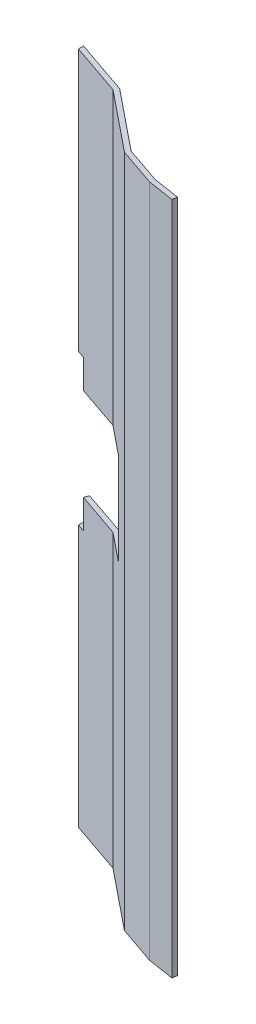
ISO-10303-21;
HEADER;
FILE_DESCRIPTION(('STEP AP214'),'2;1');
FILE_NAME('part.step','',(''),(''),'','','');
FILE_SCHEMA(('AUTOMOTIVE_DESIGN { 1 0 10303 214 1 1 1 1 }'));
ENDSEC;
DATA;
#1=APPLICATION_CONTEXT('core data for automotive mechanical design processes');
#2=APPLICATION_PROTOCOL_DEFINITION('international standard','automotive_design',2000,#1);
#3=PRODUCT_CONTEXT('',#1,'mechanical');
#4=PRODUCT('Part','Part','',(#3));
#5=PRODUCT_RELATED_PRODUCT_CATEGORY('part','',(#4));
#6=PRODUCT_DEFINITION_FORMATION('','',#4);
#7=PRODUCT_DEFINITION_CONTEXT('part definition',#1,'design');
#8=PRODUCT_DEFINITION('design','',#6,#7);
#9=PRODUCT_DEFINITION_SHAPE('','',#8);
#10=(LENGTH_UNIT() NAMED_UNIT(*) SI_UNIT(.MILLI.,.METRE.));
#11=(NAMED_UNIT(*) PLANE_ANGLE_UNIT() SI_UNIT($,.RADIAN.));
#12=(NAMED_UNIT(*) SI_UNIT($,.STERADIAN.) SOLID_ANGLE_UNIT());
#13=UNCERTAINTY_MEASURE_WITH_UNIT(LENGTH_MEASURE(1.E-05),#10,'distance_accuracy_value','');
#14=(GEOMETRIC_REPRESENTATION_CONTEXT(3) GLOBAL_UNCERTAINTY_ASSIGNED_CONTEXT((#13)) GLOBAL_UNIT_ASSIGNED_CONTEXT((#10,
#11,#12)) REPRESENTATION_CONTEXT('',''));
#15=CARTESIAN_POINT('',(0.,0.,0.));
#16=DIRECTION('',(0.,0.,1.));
#17=DIRECTION('',(1.,0.,0.));
#18=AXIS2_PLACEMENT_3D('',#15,#16,#17);
#19=CARTESIAN_POINT('',(-37.0625663664755,222.25,-23.5831818109705));
#20=DIRECTION('',(1.,0.,0.));
#21=DIRECTION('',(0.,0.,-1.));
#22=AXIS2_PLACEMENT_3D('',#19,#20,#21);
#23=PLANE('',#22);
#24=DIRECTION('',(0.,0.,1.));
#25=VECTOR('',#24,1.);
#26=CARTESIAN_POINT('',(-37.0625663664755,86.36,-23.5831818109705));
#27=LINE('',#26,#25);
#28=CARTESIAN_POINT('',(-37.0625663664755,86.36,-23.5831818109705));
#29=VERTEX_POINT('',#28);
#30=CARTESIAN_POINT('',(-37.0625663664755,86.36,-21.904788085952));
#31=VERTEX_POINT('',#30);
#32=EDGE_CURVE('E263',#29,#31,#27,.T.);
#33=ORIENTED_EDGE('',*,*,#32,.F.);
#34=DIRECTION('',(0.,-1.,0.));
#35=VECTOR('',#34,1.);
#36=CARTESIAN_POINT('',(-37.0625663664755,222.25,-23.5831818109705));
#37=LINE('',#36,#35);
#38=CARTESIAN_POINT('',(-37.0625663664755,0.,-23.5831818109705));
#39=VERTEX_POINT('',#38);
#40=EDGE_CURVE('E104',#29,#39,#37,.T.);
#41=ORIENTED_EDGE('',*,*,#40,.T.);
#42=DIRECTION('',(0.,0.,1.));
#43=VECTOR('',#42,1.);
#44=CARTESIAN_POINT('',(-37.0625663664755,0.,-23.5831818109705));
#45=LINE('',#44,#43);
#46=CARTESIAN_POINT('',(-37.0625663664755,0.,-21.904788085952));
#47=VERTEX_POINT('',#46);
#48=EDGE_CURVE('E169',#39,#47,#45,.T.);
#49=ORIENTED_EDGE('',*,*,#48,.T.);
#50=DIRECTION('',(0.,-1.,0.));
#51=VECTOR('',#50,1.);
#52=CARTESIAN_POINT('',(-37.0625663664755,222.25,-21.904788085952));
#53=LINE('',#52,#51);
#54=EDGE_CURVE('E231',#31,#47,#53,.T.);
#55=ORIENTED_EDGE('',*,*,#54,.F.);
#56=EDGE_LOOP('',(#33,#41,#49,#55));
#57=FACE_BOUND('',#56,.T.);
#58=ADVANCED_FACE('F39',(#57),#23,.F.);
#59=CARTESIAN_POINT('',(-37.0625663664755,222.25,-21.904788085952));
#60=DIRECTION('',(0.32461914387771,0.,-0.945844813607445));
#61=DIRECTION('',(-0.945844813607445,0.,-0.32461914387771));
#62=AXIS2_PLACEMENT_3D('',#59,#60,#61);
#63=PLANE('',#62);
#64=DIRECTION('',(0.945844813607445,0.,0.32461914387771));
#65=VECTOR('',#64,1.);
#66=CARTESIAN_POINT('',(-37.0625663664755,86.36,-21.904788085952));
#67=LINE('',#66,#65);
#68=CARTESIAN_POINT('',(-34.5748419741777,86.36,-21.0509873875569));
#69=VERTEX_POINT('',#68);
#70=EDGE_CURVE('E272',#31,#69,#67,.T.);
#71=ORIENTED_EDGE('',*,*,#70,.F.);
#72=ORIENTED_EDGE('',*,*,#54,.T.);
#73=DIRECTION('',(0.945844813607445,0.,0.32461914387771));
#74=VECTOR('',#73,1.);
#75=CARTESIAN_POINT('',(-37.0625663664755,0.,-21.904788085952));
#76=LINE('',#75,#74);
#77=CARTESIAN_POINT('',(-19.7555384832619,0.,-15.964920896652));
#78=VERTEX_POINT('',#77);
#79=EDGE_CURVE('E172',#47,#78,#76,.T.);
#80=ORIENTED_EDGE('',*,*,#79,.T.);
#81=DIRECTION('',(0.,-1.,0.));
#82=VECTOR('',#81,1.);
#83=CARTESIAN_POINT('',(-19.7555384832619,222.25,-15.964920896652));
#84=LINE('',#83,#82);
#85=CARTESIAN_POINT('',(-19.7555384832619,95.885,-15.964920896652));
#86=VERTEX_POINT('',#85);
#87=EDGE_CURVE('E226',#86,#78,#84,.T.);
#88=ORIENTED_EDGE('',*,*,#87,.F.);
#89=DIRECTION('',(0.945844813607445,0.,0.32461914387771));
#90=VECTOR('',#89,1.);
#91=CARTESIAN_POINT('',(-37.0625663664755,95.885,-21.904788085952));
#92=LINE('',#91,#90);
#93=CARTESIAN_POINT('',(-34.5748419741777,95.885,-21.0509873875569));
#94=VERTEX_POINT('',#93);
#95=EDGE_CURVE('E382',#94,#86,#92,.T.);
#96=ORIENTED_EDGE('',*,*,#95,.F.);
#97=DIRECTION('',(0.,-1.,0.));
#98=VECTOR('',#97,1.);
#99=CARTESIAN_POINT('',(-34.5748419741777,222.25,-21.0509873875569));
#100=LINE('',#99,#98);
#101=EDGE_CURVE('E273',#94,#69,#100,.T.);
#102=ORIENTED_EDGE('',*,*,#101,.T.);
#103=EDGE_LOOP('',(#71,#72,#80,#88,#96,#102));
#104=FACE_BOUND('',#103,.T.);
#105=ADVANCED_FACE('F284',(#104),#63,.F.);
#106=CARTESIAN_POINT('',(-19.7555384832619,222.25,-15.964920896652));
#107=DIRECTION('',(0.628540192781588,0.,-0.777777105640224));
#108=DIRECTION('',(-0.777777105640224,0.,-0.628540192781588));
#109=AXIS2_PLACEMENT_3D('',#106,#107,#108);
#110=PLANE('',#109);
#111=DIRECTION('',(0.777777105640224,0.,0.628540192781588));
#112=VECTOR('',#111,1.);
#113=CARTESIAN_POINT('',(-19.7555384832619,95.885,-15.964920896652));
#114=LINE('',#113,#112);
#115=CARTESIAN_POINT('',(-10.1235048545214,95.885,-8.18104524643741));
#116=VERTEX_POINT('',#115);
#117=EDGE_CURVE('E378',#86,#116,#114,.T.);
#118=ORIENTED_EDGE('',*,*,#117,.F.);
#119=ORIENTED_EDGE('',*,*,#87,.T.);
#120=DIRECTION('',(0.777777105640224,0.,0.628540192781588));
#121=VECTOR('',#120,1.);
#122=CARTESIAN_POINT('',(-19.7555384832619,0.,-15.964920896652));
#123=LINE('',#122,#121);
#124=CARTESIAN_POINT('',(-1.85654047094307E-13,0.,3.86479261003734E-13));
#125=VERTEX_POINT('',#124);
#126=EDGE_CURVE('E177',#78,#125,#123,.T.);
#127=ORIENTED_EDGE('',*,*,#126,.T.);
#128=DIRECTION('',(0.,-1.,0.));
#129=VECTOR('',#128,1.);
#130=CARTESIAN_POINT('',(-1.85654047094307E-13,222.25,3.86479261003734E-13));
#131=LINE('',#130,#129);
#132=CARTESIAN_POINT('',(-1.85654047094307E-13,222.25,3.86479261003734E-13));
#133=VERTEX_POINT('',#132);
#134=EDGE_CURVE('E222',#133,#125,#131,.T.);
#135=ORIENTED_EDGE('',*,*,#134,.F.);
#136=DIRECTION('',(0.777777105640224,0.,0.628540192781588));
#137=VECTOR('',#136,1.);
#138=CARTESIAN_POINT('',(-19.7555384832619,222.25,-15.964920896652));
#139=LINE('',#138,#137);
#140=CARTESIAN_POINT('',(-19.7555384832619,222.25,-15.964920896652));
#141=VERTEX_POINT('',#140);
#142=EDGE_CURVE('E305',#141,#133,#139,.T.);
#143=ORIENTED_EDGE('',*,*,#142,.F.);
#144=CARTESIAN_POINT('',(-19.7555384832619,126.365,-15.964920896652));
#145=VERTEX_POINT('',#144);
#146=EDGE_CURVE('E227',#141,#145,#84,.T.);
#147=ORIENTED_EDGE('',*,*,#146,.T.);
#148=DIRECTION('',(0.777777105640224,0.,0.628540192781588));
#149=VECTOR('',#148,1.);
#150=CARTESIAN_POINT('',(-19.7555384832619,126.365,-15.964920896652));
#151=LINE('',#150,#149);
#152=CARTESIAN_POINT('',(-10.1235048545214,126.365,-8.18104524643741));
#153=VERTEX_POINT('',#152);
#154=EDGE_CURVE('E368',#145,#153,#151,.T.);
#155=ORIENTED_EDGE('',*,*,#154,.T.);
#156=DIRECTION('',(0.,-1.,0.));
#157=VECTOR('',#156,1.);
#158=CARTESIAN_POINT('',(-10.1235048545214,222.25,-8.18104524643739));
#159=LINE('',#158,#157);
#160=EDGE_CURVE('E173',#153,#116,#159,.T.);
#161=ORIENTED_EDGE('',*,*,#160,.T.);
#162=EDGE_LOOP('',(#118,#119,#127,#135,#143,#147,#155,#161));
#163=FACE_BOUND('',#162,.T.);
#164=ADVANCED_FACE('F295',(#163),#110,.F.);
#165=CARTESIAN_POINT('',(0.780092902725611,222.25,-1.41066154888906));
#166=DIRECTION('',(-0.628540192781588,0.,0.777777105640224));
#167=DIRECTION('',(0.777777105640224,0.,0.628540192781588));
#168=AXIS2_PLACEMENT_3D('',#165,#166,#167);
#169=PLANE('',#168);
#170=DIRECTION('',(-0.777777105640224,0.,-0.628540192781588));
#171=VECTOR('',#170,1.);
#172=CARTESIAN_POINT('',(0.780092902725611,95.885,-1.41066154888906));
#173=LINE('',#172,#171);
#174=CARTESIAN_POINT('',(-9.5750990465936,95.885,-9.77893865156602));
#175=VERTEX_POINT('',#174);
#176=CARTESIAN_POINT('',(-18.9754455805351,95.885,-17.3755824455406));
#177=VERTEX_POINT('',#176);
#178=EDGE_CURVE('E329',#175,#177,#173,.T.);
#179=ORIENTED_EDGE('',*,*,#178,.F.);
#180=DIRECTION('',(0.,1.,0.));
#181=VECTOR('',#180,1.);
#182=CARTESIAN_POINT('',(-9.57509904659358,222.25,-9.77893865156601));
#183=LINE('',#182,#181);
#184=CARTESIAN_POINT('',(-9.5750990465936,126.365,-9.77893865156603));
#185=VERTEX_POINT('',#184);
#186=EDGE_CURVE('E11',#175,#185,#183,.T.);
#187=ORIENTED_EDGE('',*,*,#186,.T.);
#188=DIRECTION('',(-0.777777105640224,0.,-0.628540192781588));
#189=VECTOR('',#188,1.);
#190=CARTESIAN_POINT('',(0.780092902725611,126.365,-1.41066154888906));
#191=LINE('',#190,#189);
#192=CARTESIAN_POINT('',(-18.9754455805351,126.365,-17.3755824455406));
#193=VERTEX_POINT('',#192);
#194=EDGE_CURVE('E365',#185,#193,#191,.T.);
#195=ORIENTED_EDGE('',*,*,#194,.T.);
#196=DIRECTION('',(0.,-1.,0.));
#197=VECTOR('',#196,1.);
#198=CARTESIAN_POINT('',(-18.9754455805351,222.25,-17.3755824455406));
#199=LINE('',#198,#197);
#200=CARTESIAN_POINT('',(-18.9754455805351,222.25,-17.3755824455406));
#201=VERTEX_POINT('',#200);
#202=EDGE_CURVE('E157',#201,#193,#199,.T.);
#203=ORIENTED_EDGE('',*,*,#202,.F.);
#204=DIRECTION('',(-0.777777105640224,0.,-0.628540192781588));
#205=VECTOR('',#204,1.);
#206=CARTESIAN_POINT('',(0.780092902725611,222.25,-1.41066154888906));
#207=LINE('',#206,#205);
#208=CARTESIAN_POINT('',(0.780092902725611,222.25,-1.41066154888906));
#209=VERTEX_POINT('',#208);
#210=EDGE_CURVE('E138',#209,#201,#207,.T.);
#211=ORIENTED_EDGE('',*,*,#210,.F.);
#212=DIRECTION('',(0.,-1.,0.));
#213=VECTOR('',#212,1.);
#214=CARTESIAN_POINT('',(0.780092902725611,222.25,-1.41066154888906));
#215=LINE('',#214,#213);
#216=CARTESIAN_POINT('',(0.780092902725611,0.,-1.41066154888906));
#217=VERTEX_POINT('',#216);
#218=EDGE_CURVE('E148',#209,#217,#215,.T.);
#219=ORIENTED_EDGE('',*,*,#218,.T.);
#220=DIRECTION('',(-0.777777105640224,0.,-0.628540192781588));
#221=VECTOR('',#220,1.);
#222=CARTESIAN_POINT('',(0.780092902725611,0.,-1.41066154888906));
#223=LINE('',#222,#221);
#224=CARTESIAN_POINT('',(-18.9754455805351,0.,-17.3755824455406));
#225=VERTEX_POINT('',#224);
#226=EDGE_CURVE('E194',#217,#225,#223,.T.);
#227=ORIENTED_EDGE('',*,*,#226,.T.);
#228=EDGE_CURVE('E205',#177,#225,#199,.T.);
#229=ORIENTED_EDGE('',*,*,#228,.F.);
#230=EDGE_LOOP('',(#179,#187,#195,#203,#211,#219,#227,#229));
#231=FACE_BOUND('',#230,.T.);
#232=ADVANCED_FACE('F160',(#231),#169,.F.);
#233=CARTESIAN_POINT('',(-18.9754455805351,222.25,-17.3755824455406));
#234=DIRECTION('',(-0.32461914387771,0.,0.945844813607445));
#235=DIRECTION('',(0.945844813607445,0.,0.32461914387771));
#236=AXIS2_PLACEMENT_3D('',#233,#234,#235);
#237=PLANE('',#236);
#238=DIRECTION('',(-0.945844813607445,0.,-0.32461914387771));
#239=VECTOR('',#238,1.);
#240=CARTESIAN_POINT('',(-18.9754455805351,86.36,-17.3755824455406));
#241=LINE('',#240,#239);
#242=CARTESIAN_POINT('',(-34.0595090832718,86.36,-22.5525160291587));
#243=VERTEX_POINT('',#242);
#244=EDGE_CURVE('E48',#243,#29,#241,.T.);
#245=ORIENTED_EDGE('',*,*,#244,.F.);
#246=DIRECTION('',(0.,1.,0.));
#247=VECTOR('',#246,1.);
#248=CARTESIAN_POINT('',(-34.0595090832718,222.25,-22.5525160291587));
#249=LINE('',#248,#247);
#250=CARTESIAN_POINT('',(-34.0595090832718,95.885,-22.5525160291588));
#251=VERTEX_POINT('',#250);
#252=EDGE_CURVE('E250',#243,#251,#249,.T.);
#253=ORIENTED_EDGE('',*,*,#252,.T.);
#254=DIRECTION('',(-0.945844813607445,0.,-0.32461914387771));
#255=VECTOR('',#254,1.);
#256=CARTESIAN_POINT('',(-18.9754455805351,95.885,-17.3755824455406));
#257=LINE('',#256,#255);
#258=EDGE_CURVE('E246',#177,#251,#257,.T.);
#259=ORIENTED_EDGE('',*,*,#258,.F.);
#260=ORIENTED_EDGE('',*,*,#228,.T.);
#261=DIRECTION('',(-0.945844813607445,0.,-0.32461914387771));
#262=VECTOR('',#261,1.);
#263=CARTESIAN_POINT('',(-18.9754455805351,0.,-17.3755824455406));
#264=LINE('',#263,#262);
#265=EDGE_CURVE('E197',#225,#39,#264,.T.);
#266=ORIENTED_EDGE('',*,*,#265,.T.);
#267=ORIENTED_EDGE('',*,*,#40,.F.);
#268=EDGE_LOOP('',(#245,#253,#259,#260,#266,#267));
#269=FACE_BOUND('',#268,.T.);
#270=ADVANCED_FACE('F275',(#269),#237,.F.);
#271=CARTESIAN_POINT('',(-37.0625663664755,222.25,-23.5831818109705));
#272=VERTEX_POINT('',#271);
#273=CARTESIAN_POINT('',(-37.0625663664755,135.89,-23.5831818109705));
#274=VERTEX_POINT('',#273);
#275=EDGE_CURVE('E201',#272,#274,#37,.T.);
#276=ORIENTED_EDGE('',*,*,#275,.T.);
#277=DIRECTION('',(0.,0.,1.));
#278=VECTOR('',#277,1.);
#279=CARTESIAN_POINT('',(-37.0625663664755,135.89,-23.5831818109705));
#280=LINE('',#279,#278);
#281=CARTESIAN_POINT('',(-37.0625663664755,135.89,-21.904788085952));
#282=VERTEX_POINT('',#281);
#283=EDGE_CURVE('E389',#274,#282,#280,.T.);
#284=ORIENTED_EDGE('',*,*,#283,.T.);
#285=CARTESIAN_POINT('',(-37.0625663664755,222.25,-21.904788085952));
#286=VERTEX_POINT('',#285);
#287=EDGE_CURVE('E232',#286,#282,#53,.T.);
#288=ORIENTED_EDGE('',*,*,#287,.F.);
#289=DIRECTION('',(0.,0.,1.));
#290=VECTOR('',#289,1.);
#291=CARTESIAN_POINT('',(-37.0625663664755,222.25,-23.5831818109705));
#292=LINE('',#291,#290);
#293=EDGE_CURVE('E200',#272,#286,#292,.T.);
#294=ORIENTED_EDGE('',*,*,#293,.F.);
#295=EDGE_LOOP('',(#276,#284,#288,#294));
#296=FACE_BOUND('',#295,.T.);
#297=ADVANCED_FACE('F41',(#296),#23,.F.);
#298=ORIENTED_EDGE('',*,*,#287,.T.);
#299=DIRECTION('',(0.945844813607445,0.,0.32461914387771));
#300=VECTOR('',#299,1.);
#301=CARTESIAN_POINT('',(-37.0625663664755,135.89,-21.904788085952));
#302=LINE('',#301,#300);
#303=CARTESIAN_POINT('',(-34.5748419741777,135.89,-21.0509873875569));
#304=VERTEX_POINT('',#303);
#305=EDGE_CURVE('E393',#282,#304,#302,.T.);
#306=ORIENTED_EDGE('',*,*,#305,.T.);
#307=DIRECTION('',(0.,1.,0.));
#308=VECTOR('',#307,1.);
#309=CARTESIAN_POINT('',(-34.5748419741777,222.25,-21.0509873875569));
#310=LINE('',#309,#308);
#311=CARTESIAN_POINT('',(-34.5748419741777,126.365,-21.0509873875569));
#312=VERTEX_POINT('',#311);
#313=EDGE_CURVE('E397',#312,#304,#310,.T.);
#314=ORIENTED_EDGE('',*,*,#313,.F.);
#315=DIRECTION('',(0.945844813607445,0.,0.32461914387771));
#316=VECTOR('',#315,1.);
#317=CARTESIAN_POINT('',(-37.0625663664755,126.365,-21.904788085952));
#318=LINE('',#317,#316);
#319=EDGE_CURVE('E372',#312,#145,#318,.T.);
#320=ORIENTED_EDGE('',*,*,#319,.T.);
#321=ORIENTED_EDGE('',*,*,#146,.F.);
#322=DIRECTION('',(0.945844813607445,0.,0.32461914387771));
#323=VECTOR('',#322,1.);
#324=CARTESIAN_POINT('',(-37.0625663664755,222.25,-21.904788085952));
#325=LINE('',#324,#323);
#326=EDGE_CURVE('E113',#286,#141,#325,.T.);
#327=ORIENTED_EDGE('',*,*,#326,.F.);
#328=EDGE_LOOP('',(#298,#306,#314,#320,#321,#327));
#329=FACE_BOUND('',#328,.T.);
#330=ADVANCED_FACE('F408',(#329),#63,.F.);
#331=CARTESIAN_POINT('',(-1.85654047094307E-13,222.25,3.86479261003734E-13));
#332=DIRECTION('',(0.32461914387771,0.,-0.945844813607445));
#333=DIRECTION('',(-0.945844813607445,0.,-0.32461914387771));
#334=AXIS2_PLACEMENT_3D('',#331,#332,#333);
#335=PLANE('',#334);
#336=DIRECTION('',(0.945844813607445,0.,0.32461914387771));
#337=VECTOR('',#336,1.);
#338=CARTESIAN_POINT('',(-1.85654047094307E-13,0.,3.86479261003734E-13));
#339=LINE('',#338,#337);
#340=CARTESIAN_POINT('',(12.5417491564539,0.,4.30439731267288));
#341=VERTEX_POINT('',#340);
#342=EDGE_CURVE('E180',#125,#341,#339,.T.);
#343=ORIENTED_EDGE('',*,*,#342,.T.);
#344=DIRECTION('',(0.,-1.,0.));
#345=VECTOR('',#344,1.);
#346=CARTESIAN_POINT('',(12.5417491564539,222.25,4.30439731267288));
#347=LINE('',#346,#345);
#348=CARTESIAN_POINT('',(12.5417491564539,222.25,4.30439731267288));
#349=VERTEX_POINT('',#348);
#350=EDGE_CURVE('E218',#349,#341,#347,.T.);
#351=ORIENTED_EDGE('',*,*,#350,.F.);
#352=DIRECTION('',(0.945844813607445,0.,0.32461914387771));
#353=VECTOR('',#352,1.);
#354=CARTESIAN_POINT('',(-1.85654047094307E-13,222.25,3.86479261003734E-13));
#355=LINE('',#354,#353);
#356=EDGE_CURVE('E301',#133,#349,#355,.T.);
#357=ORIENTED_EDGE('',*,*,#356,.F.);
#358=ORIENTED_EDGE('',*,*,#134,.T.);
#359=EDGE_LOOP('',(#343,#351,#357,#358));
#360=FACE_BOUND('',#359,.T.);
#361=ADVANCED_FACE('F299',(#360),#335,.F.);
#362=CARTESIAN_POINT('',(12.5417491564539,222.25,4.30439731267288));
#363=DIRECTION('',(0.155443221428295,0.,-0.987844828357164));
#364=DIRECTION('',(-0.987844828357164,0.,-0.155443221428295));
#365=AXIS2_PLACEMENT_3D('',#362,#363,#364);
#366=PLANE('',#365);
#367=DIRECTION('',(0.987844828357164,0.,0.155443221428295));
#368=VECTOR('',#367,1.);
#369=CARTESIAN_POINT('',(12.5417491564539,0.,4.30439731267288));
#370=LINE('',#369,#368);
#371=CARTESIAN_POINT('',(21.3236896805516,0.,5.68628755117083));
#372=VERTEX_POINT('',#371);
#373=EDGE_CURVE('E183',#341,#372,#370,.T.);
#374=ORIENTED_EDGE('',*,*,#373,.T.);
#375=DIRECTION('',(0.,-1.,0.));
#376=VECTOR('',#375,1.);
#377=CARTESIAN_POINT('',(21.3236896805516,222.25,5.68628755117083));
#378=LINE('',#377,#376);
#379=CARTESIAN_POINT('',(21.3236896805516,222.25,5.68628755117083));
#380=VERTEX_POINT('',#379);
#381=EDGE_CURVE('E214',#380,#372,#378,.T.);
#382=ORIENTED_EDGE('',*,*,#381,.F.);
#383=DIRECTION('',(0.987844828357164,0.,0.155443221428295));
#384=VECTOR('',#383,1.);
#385=CARTESIAN_POINT('',(12.5417491564539,222.25,4.30439731267288));
#386=LINE('',#385,#384);
#387=EDGE_CURVE('E304',#349,#380,#386,.T.);
#388=ORIENTED_EDGE('',*,*,#387,.F.);
#389=ORIENTED_EDGE('',*,*,#350,.T.);
#390=EDGE_LOOP('',(#374,#382,#388,#389));
#391=FACE_BOUND('',#390,.T.);
#392=ADVANCED_FACE('F493',(#391),#366,.F.);
#393=CARTESIAN_POINT('',(21.3236896805516,222.25,5.68628755117083));
#394=DIRECTION('',(-0.987844828357163,0.,-0.155443221428296));
#395=DIRECTION('',(-0.155443221428296,0.,0.987844828357163));
#396=AXIS2_PLACEMENT_3D('',#393,#394,#395);
#397=PLANE('',#396);
#398=DIRECTION('',(0.155443221428296,0.,-0.987844828357163));
#399=VECTOR('',#398,1.);
#400=CARTESIAN_POINT('',(21.3236896805516,0.,5.68628755117083));
#401=LINE('',#400,#399);
#402=CARTESIAN_POINT('',(21.5742625596366,0.,4.09389181685581));
#403=VERTEX_POINT('',#402);
#404=EDGE_CURVE('E186',#372,#403,#401,.T.);
#405=ORIENTED_EDGE('',*,*,#404,.T.);
#406=DIRECTION('',(0.,-1.,0.));
#407=VECTOR('',#406,1.);
#408=CARTESIAN_POINT('',(21.5742625596366,222.25,4.09389181685581));
#409=LINE('',#408,#407);
#410=CARTESIAN_POINT('',(21.5742625596366,222.25,4.09389181685581));
#411=VERTEX_POINT('',#410);
#412=EDGE_CURVE('E210',#411,#403,#409,.T.);
#413=ORIENTED_EDGE('',*,*,#412,.F.);
#414=DIRECTION('',(0.155443221428296,0.,-0.987844828357163));
#415=VECTOR('',#414,1.);
#416=CARTESIAN_POINT('',(21.3236896805516,222.25,5.68628755117083));
#417=LINE('',#416,#415);
#418=EDGE_CURVE('E309',#380,#411,#417,.T.);
#419=ORIENTED_EDGE('',*,*,#418,.F.);
#420=ORIENTED_EDGE('',*,*,#381,.T.);
#421=EDGE_LOOP('',(#405,#413,#419,#420));
#422=FACE_BOUND('',#421,.T.);
#423=ADVANCED_FACE('F320',(#422),#397,.F.);
#424=CARTESIAN_POINT('',(21.5742625596366,222.25,4.09389181685581));
#425=DIRECTION('',(-0.155443221428295,0.,0.987844828357164));
#426=DIRECTION('',(0.987844828357164,0.,0.155443221428295));
#427=AXIS2_PLACEMENT_3D('',#424,#425,#426);
#428=PLANE('',#427);
#429=DIRECTION('',(-0.987844828357164,0.,-0.155443221428295));
#430=VECTOR('',#429,1.);
#431=CARTESIAN_POINT('',(21.5742625596366,0.,4.09389181685581));
#432=LINE('',#431,#430);
#433=CARTESIAN_POINT('',(12.7923220355414,0.,2.71200157835827));
#434=VERTEX_POINT('',#433);
#435=EDGE_CURVE('E189',#403,#434,#432,.T.);
#436=ORIENTED_EDGE('',*,*,#435,.T.);
#437=DIRECTION('',(0.,-1.,0.));
#438=VECTOR('',#437,1.);
#439=CARTESIAN_POINT('',(12.7923220355414,222.25,2.71200157835827));
#440=LINE('',#439,#438);
#441=CARTESIAN_POINT('',(12.7923220355414,222.25,2.71200157835827));
#442=VERTEX_POINT('',#441);
#443=EDGE_CURVE('E156',#442,#434,#440,.T.);
#444=ORIENTED_EDGE('',*,*,#443,.F.);
#445=DIRECTION('',(-0.987844828357164,0.,-0.155443221428295));
#446=VECTOR('',#445,1.);
#447=CARTESIAN_POINT('',(21.5742625596366,222.25,4.09389181685581));
#448=LINE('',#447,#446);
#449=EDGE_CURVE('E141',#411,#442,#448,.T.);
#450=ORIENTED_EDGE('',*,*,#449,.F.);
#451=ORIENTED_EDGE('',*,*,#412,.T.);
#452=EDGE_LOOP('',(#436,#444,#450,#451));
#453=FACE_BOUND('',#452,.T.);
#454=ADVANCED_FACE('F324',(#453),#428,.F.);
#455=CARTESIAN_POINT('',(12.7923220355414,222.25,2.71200157835827));
#456=DIRECTION('',(-0.32461914387771,0.,0.945844813607445));
#457=DIRECTION('',(0.945844813607445,0.,0.32461914387771));
#458=AXIS2_PLACEMENT_3D('',#455,#456,#457);
#459=PLANE('',#458);
#460=DIRECTION('',(-0.945844813607445,0.,-0.32461914387771));
#461=VECTOR('',#460,1.);
#462=CARTESIAN_POINT('',(12.7923220355414,0.,2.71200157835827));
#463=LINE('',#462,#461);
#464=EDGE_CURVE('E151',#434,#217,#463,.T.);
#465=ORIENTED_EDGE('',*,*,#464,.T.);
#466=ORIENTED_EDGE('',*,*,#218,.F.);
#467=DIRECTION('',(-0.945844813607445,0.,-0.32461914387771));
#468=VECTOR('',#467,1.);
#469=CARTESIAN_POINT('',(12.7923220355414,222.25,2.71200157835827));
#470=LINE('',#469,#468);
#471=EDGE_CURVE('E134',#442,#209,#470,.T.);
#472=ORIENTED_EDGE('',*,*,#471,.F.);
#473=ORIENTED_EDGE('',*,*,#443,.T.);
#474=EDGE_LOOP('',(#465,#466,#472,#473));
#475=FACE_BOUND('',#474,.T.);
#476=ADVANCED_FACE('F149',(#475),#459,.F.);
#477=DIRECTION('',(0.,-1.,0.));
#478=VECTOR('',#477,1.);
#479=CARTESIAN_POINT('',(-34.0595090832718,222.25,-22.5525160291587));
#480=LINE('',#479,#478);
#481=CARTESIAN_POINT('',(-34.0595090832718,135.89,-22.5525160291587));
#482=VERTEX_POINT('',#481);
#483=CARTESIAN_POINT('',(-34.0595090832718,126.365,-22.5525160291587));
#484=VERTEX_POINT('',#483);
#485=EDGE_CURVE('E239',#482,#484,#480,.T.);
#486=ORIENTED_EDGE('',*,*,#485,.F.);
#487=DIRECTION('',(-0.945844813607445,0.,-0.32461914387771));
#488=VECTOR('',#487,1.);
#489=CARTESIAN_POINT('',(-18.9754455805351,135.89,-17.3755824455406));
#490=LINE('',#489,#488);
#491=EDGE_CURVE('E242',#482,#274,#490,.T.);
#492=ORIENTED_EDGE('',*,*,#491,.T.);
#493=ORIENTED_EDGE('',*,*,#275,.F.);
#494=DIRECTION('',(-0.945844813607445,0.,-0.32461914387771));
#495=VECTOR('',#494,1.);
#496=CARTESIAN_POINT('',(-18.9754455805351,222.25,-17.3755824455406));
#497=LINE('',#496,#495);
#498=EDGE_CURVE('E64',#201,#272,#497,.T.);
#499=ORIENTED_EDGE('',*,*,#498,.F.);
#500=ORIENTED_EDGE('',*,*,#202,.T.);
#501=DIRECTION('',(-0.945844813607445,0.,-0.32461914387771));
#502=VECTOR('',#501,1.);
#503=CARTESIAN_POINT('',(-18.9754455805351,126.365,-17.3755824455406));
#504=LINE('',#503,#502);
#505=EDGE_CURVE('E235',#193,#484,#504,.T.);
#506=ORIENTED_EDGE('',*,*,#505,.T.);
#507=EDGE_LOOP('',(#486,#492,#493,#499,#500,#506));
#508=FACE_BOUND('',#507,.T.);
#509=ADVANCED_FACE('F443',(#508),#237,.F.);
#510=CARTESIAN_POINT('',(0.,222.25,0.));
#511=DIRECTION('',(0.,1.,0.));
#512=DIRECTION('',(0.,0.,1.));
#513=AXIS2_PLACEMENT_3D('',#510,#511,#512);
#514=PLANE('',#513);
#515=ORIENTED_EDGE('',*,*,#293,.T.);
#516=ORIENTED_EDGE('',*,*,#326,.T.);
#517=ORIENTED_EDGE('',*,*,#142,.T.);
#518=ORIENTED_EDGE('',*,*,#356,.T.);
#519=ORIENTED_EDGE('',*,*,#387,.T.);
#520=ORIENTED_EDGE('',*,*,#418,.T.);
#521=ORIENTED_EDGE('',*,*,#449,.T.);
#522=ORIENTED_EDGE('',*,*,#471,.T.);
#523=ORIENTED_EDGE('',*,*,#210,.T.);
#524=ORIENTED_EDGE('',*,*,#498,.T.);
#525=EDGE_LOOP('',(#515,#516,#517,#518,#519,#520,#521,#522,#523,#524));
#526=FACE_BOUND('',#525,.T.);
#527=ADVANCED_FACE('F136',(#526),#514,.T.);
#528=CARTESIAN_POINT('',(0.,0.,0.));
#529=DIRECTION('',(0.,1.,0.));
#530=DIRECTION('',(0.,0.,1.));
#531=AXIS2_PLACEMENT_3D('',#528,#529,#530);
#532=PLANE('',#531);
#533=ORIENTED_EDGE('',*,*,#48,.F.);
#534=ORIENTED_EDGE('',*,*,#265,.F.);
#535=ORIENTED_EDGE('',*,*,#226,.F.);
#536=ORIENTED_EDGE('',*,*,#464,.F.);
#537=ORIENTED_EDGE('',*,*,#435,.F.);
#538=ORIENTED_EDGE('',*,*,#404,.F.);
#539=ORIENTED_EDGE('',*,*,#373,.F.);
#540=ORIENTED_EDGE('',*,*,#342,.F.);
#541=ORIENTED_EDGE('',*,*,#126,.F.);
#542=ORIENTED_EDGE('',*,*,#79,.F.);
#543=EDGE_LOOP('',(#533,#534,#535,#536,#537,#538,#539,#540,#541,#542));
#544=FACE_BOUND('',#543,.T.);
#545=ADVANCED_FACE('F289',(#544),#532,.F.);
#546=CARTESIAN_POINT('',(-17.2200948165055,0.,12.496332956402));
#547=DIRECTION('',(0.945844813607445,0.,0.32461914387771));
#548=DIRECTION('',(0.32461914387771,0.,-0.945844813607445));
#549=AXIS2_PLACEMENT_3D('',#546,#547,#548);
#550=PLANE('',#549);
#551=DIRECTION('',(0.32461914387771,0.,-0.945844813607445));
#552=VECTOR('',#551,1.);
#553=CARTESIAN_POINT('',(-17.2200948165055,126.365,12.496332956402));
#554=LINE('',#553,#552);
#555=EDGE_CURVE('E356',#153,#185,#554,.T.);
#556=ORIENTED_EDGE('',*,*,#555,.T.);
#557=ORIENTED_EDGE('',*,*,#186,.F.);
#558=DIRECTION('',(0.32461914387771,0.,-0.945844813607445));
#559=VECTOR('',#558,1.);
#560=CARTESIAN_POINT('',(-17.2200948165055,95.885,12.496332956402));
#561=LINE('',#560,#559);
#562=EDGE_CURVE('E350',#116,#175,#561,.T.);
#563=ORIENTED_EDGE('',*,*,#562,.F.);
#564=ORIENTED_EDGE('',*,*,#160,.F.);
#565=EDGE_LOOP('',(#556,#557,#563,#564));
#566=FACE_BOUND('',#565,.T.);
#567=ADVANCED_FACE('F454',(#566),#550,.F.);
#568=CARTESIAN_POINT('',(-43.0463874520568,0.,3.63260723282109));
#569=DIRECTION('',(-0.945844813607445,0.,-0.32461914387771));
#570=DIRECTION('',(-0.32461914387771,0.,0.945844813607445));
#571=AXIS2_PLACEMENT_3D('',#568,#569,#570);
#572=PLANE('',#571);
#573=ORIENTED_EDGE('',*,*,#313,.T.);
#574=DIRECTION('',(0.32461914387771,0.,-0.945844813607445));
#575=VECTOR('',#574,1.);
#576=CARTESIAN_POINT('',(-43.0463874520568,135.89,3.63260723282109));
#577=LINE('',#576,#575);
#578=EDGE_CURVE('E354',#304,#482,#577,.T.);
#579=ORIENTED_EDGE('',*,*,#578,.T.);
#580=ORIENTED_EDGE('',*,*,#485,.T.);
#581=DIRECTION('',(0.32461914387771,0.,-0.945844813607445));
#582=VECTOR('',#581,1.);
#583=CARTESIAN_POINT('',(-43.0463874520568,126.365,3.63260723282108));
#584=LINE('',#583,#582);
#585=EDGE_CURVE('E55',#312,#484,#584,.T.);
#586=ORIENTED_EDGE('',*,*,#585,.F.);
#587=EDGE_LOOP('',(#573,#579,#580,#586));
#588=FACE_BOUND('',#587,.T.);
#589=ADVANCED_FACE('F445',(#588),#572,.T.);
#590=CARTESIAN_POINT('',(-5.65147781055028,135.89,16.4667459610462));
#591=DIRECTION('',(0.,1.,0.));
#592=DIRECTION('',(0.,0.,1.));
#593=AXIS2_PLACEMENT_3D('',#590,#591,#592);
#594=PLANE('',#593);
#595=ORIENTED_EDGE('',*,*,#283,.F.);
#596=ORIENTED_EDGE('',*,*,#491,.F.);
#597=ORIENTED_EDGE('',*,*,#578,.F.);
#598=ORIENTED_EDGE('',*,*,#305,.F.);
#599=EDGE_LOOP('',(#595,#596,#597,#598));
#600=FACE_BOUND('',#599,.T.);
#601=ADVANCED_FACE('F439',(#600),#594,.F.);
#602=CARTESIAN_POINT('',(-5.65147781055028,86.36,16.4667459610462));
#603=DIRECTION('',(0.,1.,0.));
#604=DIRECTION('',(0.,0.,1.));
#605=AXIS2_PLACEMENT_3D('',#602,#603,#604);
#606=PLANE('',#605);
#607=ORIENTED_EDGE('',*,*,#70,.T.);
#608=DIRECTION('',(0.32461914387771,0.,-0.945844813607445));
#609=VECTOR('',#608,1.);
#610=CARTESIAN_POINT('',(-43.0463874520568,86.36,3.63260723282109));
#611=LINE('',#610,#609);
#612=EDGE_CURVE('E267',#69,#243,#611,.T.);
#613=ORIENTED_EDGE('',*,*,#612,.T.);
#614=ORIENTED_EDGE('',*,*,#244,.T.);
#615=ORIENTED_EDGE('',*,*,#32,.T.);
#616=EDGE_LOOP('',(#607,#613,#614,#615));
#617=FACE_BOUND('',#616,.T.);
#618=ADVANCED_FACE('F261',(#617),#606,.T.);
#619=CARTESIAN_POINT('',(-43.0463874520568,0.,3.63260723282108));
#620=DIRECTION('',(0.945844813607445,0.,0.32461914387771));
#621=DIRECTION('',(0.32461914387771,0.,-0.945844813607445));
#622=AXIS2_PLACEMENT_3D('',#619,#620,#621);
#623=PLANE('',#622);
#624=DIRECTION('',(0.32461914387771,0.,-0.945844813607445));
#625=VECTOR('',#624,1.);
#626=CARTESIAN_POINT('',(-43.0463874520568,95.885,3.63260723282108));
#627=LINE('',#626,#625);
#628=EDGE_CURVE('E341',#94,#251,#627,.T.);
#629=ORIENTED_EDGE('',*,*,#628,.T.);
#630=ORIENTED_EDGE('',*,*,#252,.F.);
#631=ORIENTED_EDGE('',*,*,#612,.F.);
#632=ORIENTED_EDGE('',*,*,#101,.F.);
#633=EDGE_LOOP('',(#629,#630,#631,#632));
#634=FACE_BOUND('',#633,.T.);
#635=ADVANCED_FACE('F348',(#634),#623,.F.);
#636=CARTESIAN_POINT('',(-5.65147781055028,95.885,16.4667459610462));
#637=DIRECTION('',(0.,1.,0.));
#638=DIRECTION('',(0.,0.,1.));
#639=AXIS2_PLACEMENT_3D('',#636,#637,#638);
#640=PLANE('',#639);
#641=ORIENTED_EDGE('',*,*,#95,.T.);
#642=ORIENTED_EDGE('',*,*,#117,.T.);
#643=ORIENTED_EDGE('',*,*,#562,.T.);
#644=ORIENTED_EDGE('',*,*,#178,.T.);
#645=ORIENTED_EDGE('',*,*,#258,.T.);
#646=ORIENTED_EDGE('',*,*,#628,.F.);
#647=EDGE_LOOP('',(#641,#642,#643,#644,#645,#646));
#648=FACE_BOUND('',#647,.T.);
#649=ADVANCED_FACE('F339',(#648),#640,.T.);
#650=CARTESIAN_POINT('',(-5.65147781055028,126.365,16.4667459610462));
#651=DIRECTION('',(0.,1.,0.));
#652=DIRECTION('',(0.,0.,1.));
#653=AXIS2_PLACEMENT_3D('',#650,#651,#652);
#654=PLANE('',#653);
#655=ORIENTED_EDGE('',*,*,#585,.T.);
#656=ORIENTED_EDGE('',*,*,#505,.F.);
#657=ORIENTED_EDGE('',*,*,#194,.F.);
#658=ORIENTED_EDGE('',*,*,#555,.F.);
#659=ORIENTED_EDGE('',*,*,#154,.F.);
#660=ORIENTED_EDGE('',*,*,#319,.F.);
#661=EDGE_LOOP('',(#655,#656,#657,#658,#659,#660));
#662=FACE_BOUND('',#661,.T.);
#663=ADVANCED_FACE('F455',(#662),#654,.F.);
#664=CLOSED_SHELL('',(#58,#105,#164,#232,#270,#297,#330,#361,#392,#423,#454,#476,#509,#527,#545,
#567,#589,#601,#618,#635,#649,#663));
#665=MANIFOLD_SOLID_BREP('B2',#664);
#666=ADVANCED_BREP_SHAPE_REPRESENTATION('',(#18,#665),#14);
#667=SHAPE_DEFINITION_REPRESENTATION(#9,#666);
ENDSEC;
END-ISO-10303-21;
